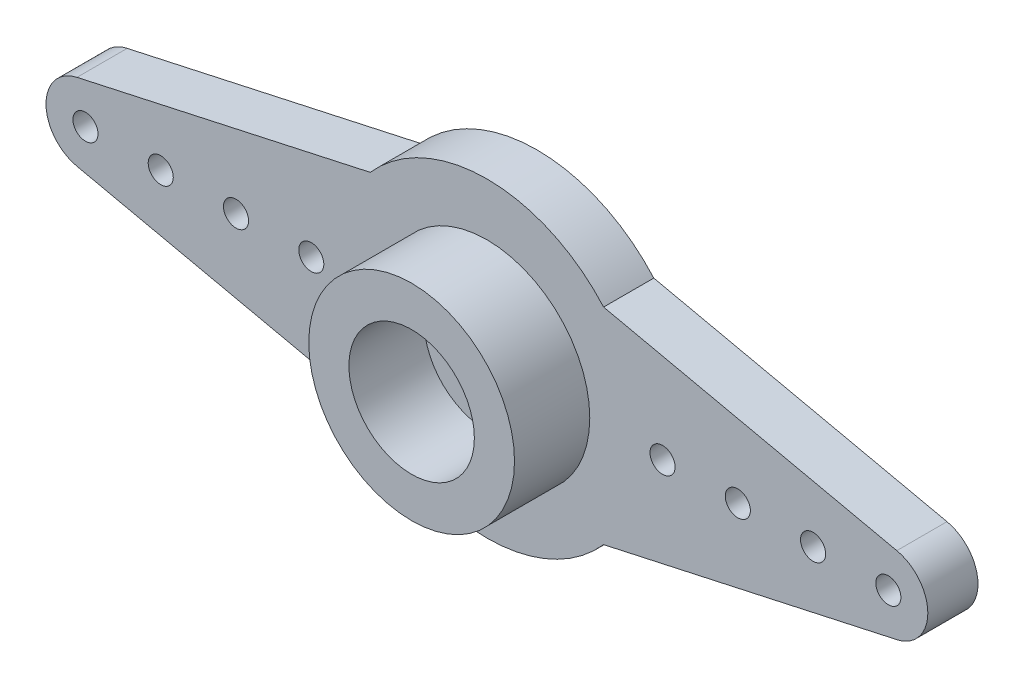
ISO-10303-21;
HEADER;
FILE_DESCRIPTION(('STEP AP214'),'2;1');
FILE_NAME('part.step','',(''),(''),'','','');
FILE_SCHEMA(('AUTOMOTIVE_DESIGN { 1 0 10303 214 1 1 1 1 }'));
ENDSEC;
DATA;
#1=APPLICATION_CONTEXT('core data for automotive mechanical design processes');
#2=APPLICATION_PROTOCOL_DEFINITION('international standard','automotive_design',2000,#1);
#3=PRODUCT_CONTEXT('',#1,'mechanical');
#4=PRODUCT('Part','Part','',(#3));
#5=PRODUCT_RELATED_PRODUCT_CATEGORY('part','',(#4));
#6=PRODUCT_DEFINITION_FORMATION('','',#4);
#7=PRODUCT_DEFINITION_CONTEXT('part definition',#1,'design');
#8=PRODUCT_DEFINITION('design','',#6,#7);
#9=PRODUCT_DEFINITION_SHAPE('','',#8);
#10=(LENGTH_UNIT() NAMED_UNIT(*) SI_UNIT(.MILLI.,.METRE.));
#11=(NAMED_UNIT(*) PLANE_ANGLE_UNIT() SI_UNIT($,.RADIAN.));
#12=(NAMED_UNIT(*) SI_UNIT($,.STERADIAN.) SOLID_ANGLE_UNIT());
#13=UNCERTAINTY_MEASURE_WITH_UNIT(LENGTH_MEASURE(1.E-05),#10,'distance_accuracy_value','');
#14=(GEOMETRIC_REPRESENTATION_CONTEXT(3) GLOBAL_UNCERTAINTY_ASSIGNED_CONTEXT((#13)) GLOBAL_UNIT_ASSIGNED_CONTEXT((#10,
#11,#12)) REPRESENTATION_CONTEXT('',''));
#15=CARTESIAN_POINT('',(0.,0.,0.));
#16=DIRECTION('',(0.,0.,1.));
#17=DIRECTION('',(1.,0.,0.));
#18=AXIS2_PLACEMENT_3D('',#15,#16,#17);
#19=CARTESIAN_POINT('',(-16.,0.,2.));
#20=DIRECTION('',(0.,0.,1.));
#21=DIRECTION('',(1.,0.,0.));
#22=AXIS2_PLACEMENT_3D('',#19,#20,#21);
#23=PLANE('',#22);
#24=CARTESIAN_POINT('',(0.,0.,2.));
#25=DIRECTION('',(0.,0.,1.));
#26=DIRECTION('',(1.,0.,0.));
#27=AXIS2_PLACEMENT_3D('',#24,#25,#26);
#28=CIRCLE('',#27,1.5);
#29=CARTESIAN_POINT('',(1.5,0.,2.));
#30=VERTEX_POINT('',#29);
#31=EDGE_CURVE('E217',#30,#30,#28,.T.);
#32=ORIENTED_EDGE('',*,*,#31,.F.);
#33=EDGE_LOOP('',(#32));
#34=FACE_BOUND('',#33,.T.);
#35=CARTESIAN_POINT('',(0.,0.,2.));
#36=DIRECTION('',(0.,0.,1.));
#37=DIRECTION('',(1.,0.,0.));
#38=AXIS2_PLACEMENT_3D('',#35,#36,#37);
#39=CIRCLE('',#38,2.5);
#40=CARTESIAN_POINT('',(2.5,0.,2.));
#41=VERTEX_POINT('',#40);
#42=EDGE_CURVE('E11',#41,#41,#39,.F.);
#43=ORIENTED_EDGE('',*,*,#42,.F.);
#44=EDGE_LOOP('',(#43));
#45=FACE_BOUND('',#44,.T.);
#46=ADVANCED_FACE('F32',(#34,#45),#23,.T.);
#47=CARTESIAN_POINT('',(0.,0.,2.));
#48=DIRECTION('',(0.,0.,1.));
#49=DIRECTION('',(1.,0.,0.));
#50=AXIS2_PLACEMENT_3D('',#47,#48,#49);
#51=CIRCLE('',#50,4.1);
#52=CARTESIAN_POINT('',(4.1,0.,2.));
#53=VERTEX_POINT('',#52);
#54=EDGE_CURVE('E238',#53,#53,#51,.T.);
#55=ORIENTED_EDGE('',*,*,#54,.F.);
#56=EDGE_LOOP('',(#55));
#57=FACE_BOUND('',#56,.T.);
#58=CARTESIAN_POINT('',(-10.,0.,2.));
#59=DIRECTION('',(0.,0.,1.));
#60=DIRECTION('',(1.,0.,0.));
#61=AXIS2_PLACEMENT_3D('',#58,#59,#60);
#62=CIRCLE('',#61,0.500000000000001);
#63=CARTESIAN_POINT('',(-9.5,0.,2.));
#64=VERTEX_POINT('',#63);
#65=EDGE_CURVE('E223',#64,#64,#62,.T.);
#66=ORIENTED_EDGE('',*,*,#65,.F.);
#67=EDGE_LOOP('',(#66));
#68=FACE_BOUND('',#67,.T.);
#69=CARTESIAN_POINT('',(-13.,0.,2.));
#70=DIRECTION('',(0.,0.,1.));
#71=DIRECTION('',(1.,0.,0.));
#72=AXIS2_PLACEMENT_3D('',#69,#70,#71);
#73=CIRCLE('',#72,0.500000000000001);
#74=CARTESIAN_POINT('',(-12.5,0.,2.));
#75=VERTEX_POINT('',#74);
#76=EDGE_CURVE('E211',#75,#75,#73,.T.);
#77=ORIENTED_EDGE('',*,*,#76,.F.);
#78=EDGE_LOOP('',(#77));
#79=FACE_BOUND('',#78,.T.);
#80=CARTESIAN_POINT('',(10.,0.,2.));
#81=DIRECTION('',(0.,0.,1.));
#82=DIRECTION('',(1.,0.,0.));
#83=AXIS2_PLACEMENT_3D('',#80,#81,#82);
#84=CIRCLE('',#83,0.500000000000001);
#85=CARTESIAN_POINT('',(10.5,0.,2.));
#86=VERTEX_POINT('',#85);
#87=EDGE_CURVE('E199',#86,#86,#84,.T.);
#88=ORIENTED_EDGE('',*,*,#87,.F.);
#89=EDGE_LOOP('',(#88));
#90=FACE_BOUND('',#89,.T.);
#91=CARTESIAN_POINT('',(16.,0.,2.));
#92=DIRECTION('',(0.,0.,1.));
#93=DIRECTION('',(1.,0.,0.));
#94=AXIS2_PLACEMENT_3D('',#91,#92,#93);
#95=CIRCLE('',#94,0.499999999999999);
#96=CARTESIAN_POINT('',(16.5,0.,2.));
#97=VERTEX_POINT('',#96);
#98=EDGE_CURVE('E187',#97,#97,#95,.T.);
#99=ORIENTED_EDGE('',*,*,#98,.F.);
#100=EDGE_LOOP('',(#99));
#101=FACE_BOUND('',#100,.T.);
#102=CARTESIAN_POINT('',(-16.,0.,2.));
#103=DIRECTION('',(0.,0.,1.));
#104=DIRECTION('',(1.,0.,0.));
#105=AXIS2_PLACEMENT_3D('',#102,#103,#104);
#106=CIRCLE('',#105,1.57300104216656);
#107=CARTESIAN_POINT('',(-16.3370446951651,1.53646775173388,2.));
#108=VERTEX_POINT('',#107);
#109=CARTESIAN_POINT('',(-16.3370446951651,-1.53646775173388,2.));
#110=VERTEX_POINT('',#109);
#111=EDGE_CURVE('E146',#108,#110,#106,.T.);
#112=ORIENTED_EDGE('',*,*,#111,.T.);
#113=DIRECTION('',(0.976774783071748,-0.214268577152924,0.));
#114=VECTOR('',#113,1.);
#115=CARTESIAN_POINT('',(-4.65080638169339,-4.1,2.));
#116=LINE('',#115,#114);
#117=CARTESIAN_POINT('',(-4.65080638169339,-4.1,2.));
#118=VERTEX_POINT('',#117);
#119=EDGE_CURVE('E93',#110,#118,#116,.T.);
#120=ORIENTED_EDGE('',*,*,#119,.T.);
#121=CARTESIAN_POINT('',(0.,0.,2.));
#122=DIRECTION('',(0.,0.,1.));
#123=DIRECTION('',(-1.,0.,0.));
#124=AXIS2_PLACEMENT_3D('',#121,#122,#123);
#125=CIRCLE('',#124,6.2);
#126=CARTESIAN_POINT('',(4.65080638169339,-4.1,2.));
#127=VERTEX_POINT('',#126);
#128=EDGE_CURVE('E178',#118,#127,#125,.T.);
#129=ORIENTED_EDGE('',*,*,#128,.T.);
#130=DIRECTION('',(0.976774783071748,0.214268577152924,0.));
#131=VECTOR('',#130,1.);
#132=CARTESIAN_POINT('',(16.3370446951651,-1.53646775173388,2.));
#133=LINE('',#132,#131);
#134=CARTESIAN_POINT('',(16.3370446951651,-1.53646775173388,2.));
#135=VERTEX_POINT('',#134);
#136=EDGE_CURVE('E177',#127,#135,#133,.T.);
#137=ORIENTED_EDGE('',*,*,#136,.T.);
#138=CARTESIAN_POINT('',(16.,0.,2.));
#139=DIRECTION('',(0.,0.,1.));
#140=DIRECTION('',(1.,0.,0.));
#141=AXIS2_PLACEMENT_3D('',#138,#139,#140);
#142=CIRCLE('',#141,1.57300104216656);
#143=CARTESIAN_POINT('',(16.3370446951651,1.53646775173388,2.));
#144=VERTEX_POINT('',#143);
#145=EDGE_CURVE('E113',#135,#144,#142,.T.);
#146=ORIENTED_EDGE('',*,*,#145,.T.);
#147=DIRECTION('',(-0.976774783071748,0.214268577152925,0.));
#148=VECTOR('',#147,1.);
#149=CARTESIAN_POINT('',(4.65080638169339,4.1,2.));
#150=LINE('',#149,#148);
#151=CARTESIAN_POINT('',(4.65080638169339,4.1,2.));
#152=VERTEX_POINT('',#151);
#153=EDGE_CURVE('E106',#144,#152,#150,.T.);
#154=ORIENTED_EDGE('',*,*,#153,.T.);
#155=CARTESIAN_POINT('',(0.,0.,2.));
#156=DIRECTION('',(0.,0.,1.));
#157=DIRECTION('',(1.,0.,0.));
#158=AXIS2_PLACEMENT_3D('',#155,#156,#157);
#159=CIRCLE('',#158,6.2);
#160=CARTESIAN_POINT('',(-4.65080638169339,4.1,2.));
#161=VERTEX_POINT('',#160);
#162=EDGE_CURVE('E111',#152,#161,#159,.T.);
#163=ORIENTED_EDGE('',*,*,#162,.T.);
#164=DIRECTION('',(-0.976774783071748,-0.214268577152925,0.));
#165=VECTOR('',#164,1.);
#166=CARTESIAN_POINT('',(-16.3370446951651,1.53646775173388,2.));
#167=LINE('',#166,#165);
#168=EDGE_CURVE('E49',#161,#108,#167,.T.);
#169=ORIENTED_EDGE('',*,*,#168,.T.);
#170=EDGE_LOOP('',(#112,#120,#129,#137,#146,#154,#163,#169));
#171=FACE_BOUND('',#170,.T.);
#172=CARTESIAN_POINT('',(7.,0.,2.));
#173=DIRECTION('',(0.,0.,1.));
#174=DIRECTION('',(1.,0.,0.));
#175=AXIS2_PLACEMENT_3D('',#172,#173,#174);
#176=CIRCLE('',#175,0.500000000000001);
#177=CARTESIAN_POINT('',(7.5,0.,2.));
#178=VERTEX_POINT('',#177);
#179=EDGE_CURVE('E135',#178,#178,#176,.T.);
#180=ORIENTED_EDGE('',*,*,#179,.F.);
#181=EDGE_LOOP('',(#180));
#182=FACE_BOUND('',#181,.T.);
#183=CARTESIAN_POINT('',(13.,0.,2.));
#184=DIRECTION('',(0.,0.,1.));
#185=DIRECTION('',(1.,0.,0.));
#186=AXIS2_PLACEMENT_3D('',#183,#184,#185);
#187=CIRCLE('',#186,0.500000000000001);
#188=CARTESIAN_POINT('',(13.5,0.,2.));
#189=VERTEX_POINT('',#188);
#190=EDGE_CURVE('E193',#189,#189,#187,.T.);
#191=ORIENTED_EDGE('',*,*,#190,.F.);
#192=EDGE_LOOP('',(#191));
#193=FACE_BOUND('',#192,.T.);
#194=CARTESIAN_POINT('',(-16.,0.,2.));
#195=DIRECTION('',(0.,0.,1.));
#196=DIRECTION('',(1.,0.,0.));
#197=AXIS2_PLACEMENT_3D('',#194,#195,#196);
#198=CIRCLE('',#197,0.500000000000001);
#199=CARTESIAN_POINT('',(-15.5,0.,2.));
#200=VERTEX_POINT('',#199);
#201=EDGE_CURVE('E205',#200,#200,#198,.T.);
#202=ORIENTED_EDGE('',*,*,#201,.F.);
#203=EDGE_LOOP('',(#202));
#204=FACE_BOUND('',#203,.T.);
#205=CARTESIAN_POINT('',(-7.,0.,2.));
#206=DIRECTION('',(0.,0.,1.));
#207=DIRECTION('',(1.,0.,0.));
#208=AXIS2_PLACEMENT_3D('',#205,#206,#207);
#209=CIRCLE('',#208,0.500000000000001);
#210=CARTESIAN_POINT('',(-6.5,0.,2.));
#211=VERTEX_POINT('',#210);
#212=EDGE_CURVE('E229',#211,#211,#209,.T.);
#213=ORIENTED_EDGE('',*,*,#212,.F.);
#214=EDGE_LOOP('',(#213));
#215=FACE_BOUND('',#214,.T.);
#216=ADVANCED_FACE('F108',(#57,#68,#79,#90,#101,#171,#182,#193,#204,#215),#23,.T.);
#217=CARTESIAN_POINT('',(-16.,0.,0.));
#218=DIRECTION('',(0.,0.,1.));
#219=DIRECTION('',(1.,0.,0.));
#220=AXIS2_PLACEMENT_3D('',#217,#218,#219);
#221=PLANE('',#220);
#222=CARTESIAN_POINT('',(-16.,0.,0.));
#223=DIRECTION('',(0.,0.,1.));
#224=DIRECTION('',(1.,0.,0.));
#225=AXIS2_PLACEMENT_3D('',#222,#223,#224);
#226=CIRCLE('',#225,1.57300104216656);
#227=CARTESIAN_POINT('',(-16.3370446951651,1.53646775173388,0.));
#228=VERTEX_POINT('',#227);
#229=CARTESIAN_POINT('',(-16.3370446951651,-1.53646775173388,0.));
#230=VERTEX_POINT('',#229);
#231=EDGE_CURVE('E131',#228,#230,#226,.T.);
#232=ORIENTED_EDGE('',*,*,#231,.F.);
#233=DIRECTION('',(-0.976774783071748,-0.214268577152925,0.));
#234=VECTOR('',#233,1.);
#235=CARTESIAN_POINT('',(-16.3370446951651,1.53646775173388,0.));
#236=LINE('',#235,#234);
#237=CARTESIAN_POINT('',(-4.65080638169339,4.1,0.));
#238=VERTEX_POINT('',#237);
#239=EDGE_CURVE('E84',#238,#228,#236,.T.);
#240=ORIENTED_EDGE('',*,*,#239,.F.);
#241=CARTESIAN_POINT('',(0.,0.,0.));
#242=DIRECTION('',(0.,0.,1.));
#243=DIRECTION('',(1.,0.,0.));
#244=AXIS2_PLACEMENT_3D('',#241,#242,#243);
#245=CIRCLE('',#244,6.2);
#246=CARTESIAN_POINT('',(4.65080638169339,4.1,0.));
#247=VERTEX_POINT('',#246);
#248=EDGE_CURVE('E78',#247,#238,#245,.T.);
#249=ORIENTED_EDGE('',*,*,#248,.F.);
#250=DIRECTION('',(-0.976774783071748,0.214268577152925,0.));
#251=VECTOR('',#250,1.);
#252=CARTESIAN_POINT('',(4.65080638169339,4.1,0.));
#253=LINE('',#252,#251);
#254=CARTESIAN_POINT('',(16.3370446951651,1.53646775173388,0.));
#255=VERTEX_POINT('',#254);
#256=EDGE_CURVE('E121',#255,#247,#253,.T.);
#257=ORIENTED_EDGE('',*,*,#256,.F.);
#258=CARTESIAN_POINT('',(16.,0.,0.));
#259=DIRECTION('',(0.,0.,1.));
#260=DIRECTION('',(1.,0.,0.));
#261=AXIS2_PLACEMENT_3D('',#258,#259,#260);
#262=CIRCLE('',#261,1.57300104216656);
#263=CARTESIAN_POINT('',(16.3370446951651,-1.53646775173388,0.));
#264=VERTEX_POINT('',#263);
#265=EDGE_CURVE('E141',#264,#255,#262,.T.);
#266=ORIENTED_EDGE('',*,*,#265,.F.);
#267=DIRECTION('',(0.976774783071748,0.214268577152924,0.));
#268=VECTOR('',#267,1.);
#269=CARTESIAN_POINT('',(16.3370446951651,-1.53646775173388,0.));
#270=LINE('',#269,#268);
#271=CARTESIAN_POINT('',(4.65080638169339,-4.1,0.));
#272=VERTEX_POINT('',#271);
#273=EDGE_CURVE('E139',#272,#264,#270,.T.);
#274=ORIENTED_EDGE('',*,*,#273,.F.);
#275=CARTESIAN_POINT('',(0.,0.,0.));
#276=DIRECTION('',(0.,0.,1.));
#277=DIRECTION('',(-1.,0.,0.));
#278=AXIS2_PLACEMENT_3D('',#275,#276,#277);
#279=CIRCLE('',#278,6.2);
#280=CARTESIAN_POINT('',(-4.65080638169339,-4.1,0.));
#281=VERTEX_POINT('',#280);
#282=EDGE_CURVE('E137',#281,#272,#279,.T.);
#283=ORIENTED_EDGE('',*,*,#282,.F.);
#284=DIRECTION('',(0.976774783071748,-0.214268577152924,0.));
#285=VECTOR('',#284,1.);
#286=CARTESIAN_POINT('',(-4.65080638169339,-4.1,0.));
#287=LINE('',#286,#285);
#288=EDGE_CURVE('E134',#230,#281,#287,.T.);
#289=ORIENTED_EDGE('',*,*,#288,.F.);
#290=EDGE_LOOP('',(#232,#240,#249,#257,#266,#274,#283,#289));
#291=FACE_BOUND('',#290,.T.);
#292=CARTESIAN_POINT('',(7.,0.,0.));
#293=DIRECTION('',(0.,0.,1.));
#294=DIRECTION('',(1.,0.,0.));
#295=AXIS2_PLACEMENT_3D('',#292,#293,#294);
#296=CIRCLE('',#295,0.500000000000001);
#297=CARTESIAN_POINT('',(7.5,0.,0.));
#298=VERTEX_POINT('',#297);
#299=EDGE_CURVE('E184',#298,#298,#296,.T.);
#300=ORIENTED_EDGE('',*,*,#299,.T.);
#301=EDGE_LOOP('',(#300));
#302=FACE_BOUND('',#301,.T.);
#303=CARTESIAN_POINT('',(16.,0.,0.));
#304=DIRECTION('',(0.,0.,1.));
#305=DIRECTION('',(1.,0.,0.));
#306=AXIS2_PLACEMENT_3D('',#303,#304,#305);
#307=CIRCLE('',#306,0.499999999999999);
#308=CARTESIAN_POINT('',(16.5,0.,0.));
#309=VERTEX_POINT('',#308);
#310=EDGE_CURVE('E190',#309,#309,#307,.T.);
#311=ORIENTED_EDGE('',*,*,#310,.T.);
#312=EDGE_LOOP('',(#311));
#313=FACE_BOUND('',#312,.T.);
#314=CARTESIAN_POINT('',(13.,0.,0.));
#315=DIRECTION('',(0.,0.,1.));
#316=DIRECTION('',(1.,0.,0.));
#317=AXIS2_PLACEMENT_3D('',#314,#315,#316);
#318=CIRCLE('',#317,0.500000000000001);
#319=CARTESIAN_POINT('',(13.5,0.,0.));
#320=VERTEX_POINT('',#319);
#321=EDGE_CURVE('E196',#320,#320,#318,.T.);
#322=ORIENTED_EDGE('',*,*,#321,.T.);
#323=EDGE_LOOP('',(#322));
#324=FACE_BOUND('',#323,.T.);
#325=CARTESIAN_POINT('',(10.,0.,0.));
#326=DIRECTION('',(0.,0.,1.));
#327=DIRECTION('',(1.,0.,0.));
#328=AXIS2_PLACEMENT_3D('',#325,#326,#327);
#329=CIRCLE('',#328,0.500000000000001);
#330=CARTESIAN_POINT('',(10.5,0.,0.));
#331=VERTEX_POINT('',#330);
#332=EDGE_CURVE('E202',#331,#331,#329,.T.);
#333=ORIENTED_EDGE('',*,*,#332,.T.);
#334=EDGE_LOOP('',(#333));
#335=FACE_BOUND('',#334,.T.);
#336=CARTESIAN_POINT('',(-16.,0.,0.));
#337=DIRECTION('',(0.,0.,1.));
#338=DIRECTION('',(1.,0.,0.));
#339=AXIS2_PLACEMENT_3D('',#336,#337,#338);
#340=CIRCLE('',#339,0.500000000000001);
#341=CARTESIAN_POINT('',(-15.5,0.,0.));
#342=VERTEX_POINT('',#341);
#343=EDGE_CURVE('E208',#342,#342,#340,.T.);
#344=ORIENTED_EDGE('',*,*,#343,.T.);
#345=EDGE_LOOP('',(#344));
#346=FACE_BOUND('',#345,.T.);
#347=CARTESIAN_POINT('',(-13.,0.,0.));
#348=DIRECTION('',(0.,0.,1.));
#349=DIRECTION('',(1.,0.,0.));
#350=AXIS2_PLACEMENT_3D('',#347,#348,#349);
#351=CIRCLE('',#350,0.500000000000001);
#352=CARTESIAN_POINT('',(-12.5,0.,0.));
#353=VERTEX_POINT('',#352);
#354=EDGE_CURVE('E214',#353,#353,#351,.T.);
#355=ORIENTED_EDGE('',*,*,#354,.T.);
#356=EDGE_LOOP('',(#355));
#357=FACE_BOUND('',#356,.T.);
#358=CARTESIAN_POINT('',(0.,0.,0.));
#359=DIRECTION('',(0.,0.,1.));
#360=DIRECTION('',(1.,0.,0.));
#361=AXIS2_PLACEMENT_3D('',#358,#359,#360);
#362=CIRCLE('',#361,1.5);
#363=CARTESIAN_POINT('',(1.5,0.,0.));
#364=VERTEX_POINT('',#363);
#365=EDGE_CURVE('E220',#364,#364,#362,.T.);
#366=ORIENTED_EDGE('',*,*,#365,.T.);
#367=EDGE_LOOP('',(#366));
#368=FACE_BOUND('',#367,.T.);
#369=CARTESIAN_POINT('',(-10.,0.,0.));
#370=DIRECTION('',(0.,0.,1.));
#371=DIRECTION('',(1.,0.,0.));
#372=AXIS2_PLACEMENT_3D('',#369,#370,#371);
#373=CIRCLE('',#372,0.500000000000001);
#374=CARTESIAN_POINT('',(-9.5,0.,0.));
#375=VERTEX_POINT('',#374);
#376=EDGE_CURVE('E226',#375,#375,#373,.T.);
#377=ORIENTED_EDGE('',*,*,#376,.T.);
#378=EDGE_LOOP('',(#377));
#379=FACE_BOUND('',#378,.T.);
#380=CARTESIAN_POINT('',(-7.,0.,0.));
#381=DIRECTION('',(0.,0.,1.));
#382=DIRECTION('',(1.,0.,0.));
#383=AXIS2_PLACEMENT_3D('',#380,#381,#382);
#384=CIRCLE('',#383,0.500000000000001);
#385=CARTESIAN_POINT('',(-6.5,0.,0.));
#386=VERTEX_POINT('',#385);
#387=EDGE_CURVE('E232',#386,#386,#384,.T.);
#388=ORIENTED_EDGE('',*,*,#387,.T.);
#389=EDGE_LOOP('',(#388));
#390=FACE_BOUND('',#389,.T.);
#391=ADVANCED_FACE('F164',(#291,#302,#313,#324,#335,#346,#357,#368,#379,#390),#221,.F.);
#392=CARTESIAN_POINT('',(-16.,0.,2.));
#393=DIRECTION('',(0.,0.,-1.));
#394=DIRECTION('',(-1.,0.,0.));
#395=AXIS2_PLACEMENT_3D('',#392,#393,#394);
#396=CYLINDRICAL_SURFACE('',#395,1.57300104216656);
#397=ORIENTED_EDGE('',*,*,#231,.T.);
#398=DIRECTION('',(0.,0.,-1.));
#399=VECTOR('',#398,1.);
#400=CARTESIAN_POINT('',(-16.3370446951651,-1.53646775173388,2.));
#401=LINE('',#400,#399);
#402=EDGE_CURVE('E41',#110,#230,#401,.T.);
#403=ORIENTED_EDGE('',*,*,#402,.F.);
#404=ORIENTED_EDGE('',*,*,#111,.F.);
#405=DIRECTION('',(0.,0.,-1.));
#406=VECTOR('',#405,1.);
#407=CARTESIAN_POINT('',(-16.3370446951651,1.53646775173388,2.));
#408=LINE('',#407,#406);
#409=EDGE_CURVE('E127',#108,#228,#408,.T.);
#410=ORIENTED_EDGE('',*,*,#409,.T.);
#411=EDGE_LOOP('',(#397,#403,#404,#410));
#412=FACE_BOUND('',#411,.T.);
#413=ADVANCED_FACE('F34',(#412),#396,.T.);
#414=CARTESIAN_POINT('',(-4.65080638169339,-4.1,2.));
#415=DIRECTION('',(0.214268577152924,0.976774783071749,0.));
#416=DIRECTION('',(-0.976774783071749,0.214268577152924,0.));
#417=AXIS2_PLACEMENT_3D('',#414,#415,#416);
#418=PLANE('',#417);
#419=ORIENTED_EDGE('',*,*,#288,.T.);
#420=DIRECTION('',(0.,0.,-1.));
#421=VECTOR('',#420,1.);
#422=CARTESIAN_POINT('',(-4.65080638169339,-4.1,2.));
#423=LINE('',#422,#421);
#424=EDGE_CURVE('E156',#118,#281,#423,.T.);
#425=ORIENTED_EDGE('',*,*,#424,.F.);
#426=ORIENTED_EDGE('',*,*,#119,.F.);
#427=ORIENTED_EDGE('',*,*,#402,.T.);
#428=EDGE_LOOP('',(#419,#425,#426,#427));
#429=FACE_BOUND('',#428,.T.);
#430=ADVANCED_FACE('F159',(#429),#418,.F.);
#431=CARTESIAN_POINT('',(0.,0.,2.));
#432=DIRECTION('',(0.,0.,-1.));
#433=DIRECTION('',(-1.,0.,0.));
#434=AXIS2_PLACEMENT_3D('',#431,#432,#433);
#435=CYLINDRICAL_SURFACE('',#434,6.2);
#436=ORIENTED_EDGE('',*,*,#282,.T.);
#437=DIRECTION('',(0.,0.,-1.));
#438=VECTOR('',#437,1.);
#439=CARTESIAN_POINT('',(4.65080638169339,-4.1,2.));
#440=LINE('',#439,#438);
#441=EDGE_CURVE('E153',#127,#272,#440,.T.);
#442=ORIENTED_EDGE('',*,*,#441,.F.);
#443=ORIENTED_EDGE('',*,*,#128,.F.);
#444=ORIENTED_EDGE('',*,*,#424,.T.);
#445=EDGE_LOOP('',(#436,#442,#443,#444));
#446=FACE_BOUND('',#445,.T.);
#447=ADVANCED_FACE('F171',(#446),#435,.T.);
#448=CARTESIAN_POINT('',(16.3370446951651,-1.53646775173388,2.));
#449=DIRECTION('',(-0.214268577152924,0.976774783071749,0.));
#450=DIRECTION('',(-0.976774783071749,-0.214268577152924,0.));
#451=AXIS2_PLACEMENT_3D('',#448,#449,#450);
#452=PLANE('',#451);
#453=ORIENTED_EDGE('',*,*,#273,.T.);
#454=DIRECTION('',(0.,0.,-1.));
#455=VECTOR('',#454,1.);
#456=CARTESIAN_POINT('',(16.3370446951651,-1.53646775173388,2.));
#457=LINE('',#456,#455);
#458=EDGE_CURVE('E150',#135,#264,#457,.T.);
#459=ORIENTED_EDGE('',*,*,#458,.F.);
#460=ORIENTED_EDGE('',*,*,#136,.F.);
#461=ORIENTED_EDGE('',*,*,#441,.T.);
#462=EDGE_LOOP('',(#453,#459,#460,#461));
#463=FACE_BOUND('',#462,.T.);
#464=ADVANCED_FACE('F175',(#463),#452,.F.);
#465=CARTESIAN_POINT('',(16.,0.,2.));
#466=DIRECTION('',(0.,0.,-1.));
#467=DIRECTION('',(-1.,0.,0.));
#468=AXIS2_PLACEMENT_3D('',#465,#466,#467);
#469=CYLINDRICAL_SURFACE('',#468,1.57300104216656);
#470=ORIENTED_EDGE('',*,*,#265,.T.);
#471=DIRECTION('',(0.,0.,-1.));
#472=VECTOR('',#471,1.);
#473=CARTESIAN_POINT('',(16.3370446951651,1.53646775173388,2.));
#474=LINE('',#473,#472);
#475=EDGE_CURVE('E122',#144,#255,#474,.T.);
#476=ORIENTED_EDGE('',*,*,#475,.F.);
#477=ORIENTED_EDGE('',*,*,#145,.F.);
#478=ORIENTED_EDGE('',*,*,#458,.T.);
#479=EDGE_LOOP('',(#470,#476,#477,#478));
#480=FACE_BOUND('',#479,.T.);
#481=ADVANCED_FACE('F288',(#480),#469,.T.);
#482=CARTESIAN_POINT('',(4.65080638169339,4.1,2.));
#483=DIRECTION('',(-0.214268577152925,-0.976774783071748,0.));
#484=DIRECTION('',(0.976774783071749,-0.214268577152925,0.));
#485=AXIS2_PLACEMENT_3D('',#482,#483,#484);
#486=PLANE('',#485);
#487=ORIENTED_EDGE('',*,*,#256,.T.);
#488=DIRECTION('',(0.,0.,-1.));
#489=VECTOR('',#488,1.);
#490=CARTESIAN_POINT('',(4.65080638169339,4.1,2.));
#491=LINE('',#490,#489);
#492=EDGE_CURVE('E118',#152,#247,#491,.T.);
#493=ORIENTED_EDGE('',*,*,#492,.F.);
#494=ORIENTED_EDGE('',*,*,#153,.F.);
#495=ORIENTED_EDGE('',*,*,#475,.T.);
#496=EDGE_LOOP('',(#487,#493,#494,#495));
#497=FACE_BOUND('',#496,.T.);
#498=ADVANCED_FACE('F119',(#497),#486,.F.);
#499=CARTESIAN_POINT('',(0.,0.,2.));
#500=DIRECTION('',(0.,0.,-1.));
#501=DIRECTION('',(-1.,0.,0.));
#502=AXIS2_PLACEMENT_3D('',#499,#500,#501);
#503=CYLINDRICAL_SURFACE('',#502,6.2);
#504=ORIENTED_EDGE('',*,*,#248,.T.);
#505=DIRECTION('',(0.,0.,-1.));
#506=VECTOR('',#505,1.);
#507=CARTESIAN_POINT('',(-4.65080638169339,4.1,2.));
#508=LINE('',#507,#506);
#509=EDGE_CURVE('E123',#161,#238,#508,.T.);
#510=ORIENTED_EDGE('',*,*,#509,.F.);
#511=ORIENTED_EDGE('',*,*,#162,.F.);
#512=ORIENTED_EDGE('',*,*,#492,.T.);
#513=EDGE_LOOP('',(#504,#510,#511,#512));
#514=FACE_BOUND('',#513,.T.);
#515=ADVANCED_FACE('F125',(#514),#503,.T.);
#516=CARTESIAN_POINT('',(-16.3370446951651,1.53646775173388,2.));
#517=DIRECTION('',(0.214268577152925,-0.976774783071748,0.));
#518=DIRECTION('',(0.976774783071749,0.214268577152925,0.));
#519=AXIS2_PLACEMENT_3D('',#516,#517,#518);
#520=PLANE('',#519);
#521=ORIENTED_EDGE('',*,*,#239,.T.);
#522=ORIENTED_EDGE('',*,*,#409,.F.);
#523=ORIENTED_EDGE('',*,*,#168,.F.);
#524=ORIENTED_EDGE('',*,*,#509,.T.);
#525=EDGE_LOOP('',(#521,#522,#523,#524));
#526=FACE_BOUND('',#525,.T.);
#527=ADVANCED_FACE('F281',(#526),#520,.F.);
#528=CARTESIAN_POINT('',(7.,0.,2.));
#529=DIRECTION('',(0.,0.,-1.));
#530=DIRECTION('',(-1.,0.,0.));
#531=AXIS2_PLACEMENT_3D('',#528,#529,#530);
#532=CYLINDRICAL_SURFACE('',#531,0.500000000000001);
#533=ORIENTED_EDGE('',*,*,#179,.T.);
#534=EDGE_LOOP('',(#533));
#535=FACE_BOUND('',#534,.T.);
#536=ORIENTED_EDGE('',*,*,#299,.F.);
#537=EDGE_LOOP('',(#536));
#538=FACE_BOUND('',#537,.T.);
#539=ADVANCED_FACE('F277',(#535,#538),#532,.F.);
#540=CARTESIAN_POINT('',(16.,0.,2.));
#541=DIRECTION('',(0.,0.,-1.));
#542=DIRECTION('',(-1.,0.,0.));
#543=AXIS2_PLACEMENT_3D('',#540,#541,#542);
#544=CYLINDRICAL_SURFACE('',#543,0.499999999999999);
#545=ORIENTED_EDGE('',*,*,#98,.T.);
#546=EDGE_LOOP('',(#545));
#547=FACE_BOUND('',#546,.T.);
#548=ORIENTED_EDGE('',*,*,#310,.F.);
#549=EDGE_LOOP('',(#548));
#550=FACE_BOUND('',#549,.T.);
#551=ADVANCED_FACE('F390',(#547,#550),#544,.F.);
#552=CARTESIAN_POINT('',(13.,0.,2.));
#553=DIRECTION('',(0.,0.,-1.));
#554=DIRECTION('',(-1.,0.,0.));
#555=AXIS2_PLACEMENT_3D('',#552,#553,#554);
#556=CYLINDRICAL_SURFACE('',#555,0.500000000000001);
#557=ORIENTED_EDGE('',*,*,#190,.T.);
#558=EDGE_LOOP('',(#557));
#559=FACE_BOUND('',#558,.T.);
#560=ORIENTED_EDGE('',*,*,#321,.F.);
#561=EDGE_LOOP('',(#560));
#562=FACE_BOUND('',#561,.T.);
#563=ADVANCED_FACE('F381',(#559,#562),#556,.F.);
#564=CARTESIAN_POINT('',(10.,0.,2.));
#565=DIRECTION('',(0.,0.,-1.));
#566=DIRECTION('',(-1.,0.,0.));
#567=AXIS2_PLACEMENT_3D('',#564,#565,#566);
#568=CYLINDRICAL_SURFACE('',#567,0.500000000000001);
#569=ORIENTED_EDGE('',*,*,#87,.T.);
#570=EDGE_LOOP('',(#569));
#571=FACE_BOUND('',#570,.T.);
#572=ORIENTED_EDGE('',*,*,#332,.F.);
#573=EDGE_LOOP('',(#572));
#574=FACE_BOUND('',#573,.T.);
#575=ADVANCED_FACE('F372',(#571,#574),#568,.F.);
#576=CARTESIAN_POINT('',(-16.,0.,2.));
#577=DIRECTION('',(0.,0.,-1.));
#578=DIRECTION('',(-1.,0.,0.));
#579=AXIS2_PLACEMENT_3D('',#576,#577,#578);
#580=CYLINDRICAL_SURFACE('',#579,0.500000000000001);
#581=ORIENTED_EDGE('',*,*,#201,.T.);
#582=EDGE_LOOP('',(#581));
#583=FACE_BOUND('',#582,.T.);
#584=ORIENTED_EDGE('',*,*,#343,.F.);
#585=EDGE_LOOP('',(#584));
#586=FACE_BOUND('',#585,.T.);
#587=ADVANCED_FACE('F363',(#583,#586),#580,.F.);
#588=CARTESIAN_POINT('',(-13.,0.,2.));
#589=DIRECTION('',(0.,0.,-1.));
#590=DIRECTION('',(-1.,0.,0.));
#591=AXIS2_PLACEMENT_3D('',#588,#589,#590);
#592=CYLINDRICAL_SURFACE('',#591,0.500000000000001);
#593=ORIENTED_EDGE('',*,*,#76,.T.);
#594=EDGE_LOOP('',(#593));
#595=FACE_BOUND('',#594,.T.);
#596=ORIENTED_EDGE('',*,*,#354,.F.);
#597=EDGE_LOOP('',(#596));
#598=FACE_BOUND('',#597,.T.);
#599=ADVANCED_FACE('F354',(#595,#598),#592,.F.);
#600=CARTESIAN_POINT('',(0.,0.,2.));
#601=DIRECTION('',(0.,0.,-1.));
#602=DIRECTION('',(-1.,0.,0.));
#603=AXIS2_PLACEMENT_3D('',#600,#601,#602);
#604=CYLINDRICAL_SURFACE('',#603,1.5);
#605=ORIENTED_EDGE('',*,*,#31,.T.);
#606=EDGE_LOOP('',(#605));
#607=FACE_BOUND('',#606,.T.);
#608=ORIENTED_EDGE('',*,*,#365,.F.);
#609=EDGE_LOOP('',(#608));
#610=FACE_BOUND('',#609,.T.);
#611=ADVANCED_FACE('F345',(#607,#610),#604,.F.);
#612=CARTESIAN_POINT('',(-10.,0.,2.));
#613=DIRECTION('',(0.,0.,-1.));
#614=DIRECTION('',(-1.,0.,0.));
#615=AXIS2_PLACEMENT_3D('',#612,#613,#614);
#616=CYLINDRICAL_SURFACE('',#615,0.500000000000001);
#617=ORIENTED_EDGE('',*,*,#65,.T.);
#618=EDGE_LOOP('',(#617));
#619=FACE_BOUND('',#618,.T.);
#620=ORIENTED_EDGE('',*,*,#376,.F.);
#621=EDGE_LOOP('',(#620));
#622=FACE_BOUND('',#621,.T.);
#623=ADVANCED_FACE('F262',(#619,#622),#616,.F.);
#624=CARTESIAN_POINT('',(-7.,0.,2.));
#625=DIRECTION('',(0.,0.,-1.));
#626=DIRECTION('',(-1.,0.,0.));
#627=AXIS2_PLACEMENT_3D('',#624,#625,#626);
#628=CYLINDRICAL_SURFACE('',#627,0.500000000000001);
#629=ORIENTED_EDGE('',*,*,#212,.T.);
#630=EDGE_LOOP('',(#629));
#631=FACE_BOUND('',#630,.T.);
#632=ORIENTED_EDGE('',*,*,#387,.F.);
#633=EDGE_LOOP('',(#632));
#634=FACE_BOUND('',#633,.T.);
#635=ADVANCED_FACE('F253',(#631,#634),#628,.F.);
#636=CARTESIAN_POINT('',(0.,0.,5.));
#637=DIRECTION('',(0.,0.,1.));
#638=DIRECTION('',(1.,0.,0.));
#639=AXIS2_PLACEMENT_3D('',#636,#637,#638);
#640=PLANE('',#639);
#641=CARTESIAN_POINT('',(0.,0.,5.));
#642=DIRECTION('',(0.,0.,1.));
#643=DIRECTION('',(1.,0.,0.));
#644=AXIS2_PLACEMENT_3D('',#641,#642,#643);
#645=CIRCLE('',#644,4.1);
#646=CARTESIAN_POINT('',(4.1,0.,5.));
#647=VERTEX_POINT('',#646);
#648=EDGE_CURVE('E235',#647,#647,#645,.T.);
#649=ORIENTED_EDGE('',*,*,#648,.T.);
#650=EDGE_LOOP('',(#649));
#651=FACE_BOUND('',#650,.T.);
#652=CARTESIAN_POINT('',(0.,0.,5.));
#653=DIRECTION('',(0.,0.,1.));
#654=DIRECTION('',(1.,0.,0.));
#655=AXIS2_PLACEMENT_3D('',#652,#653,#654);
#656=CIRCLE('',#655,2.5);
#657=CARTESIAN_POINT('',(2.5,0.,5.));
#658=VERTEX_POINT('',#657);
#659=EDGE_CURVE('E241',#658,#658,#656,.T.);
#660=ORIENTED_EDGE('',*,*,#659,.F.);
#661=EDGE_LOOP('',(#660));
#662=FACE_BOUND('',#661,.T.);
#663=ADVANCED_FACE('F250',(#651,#662),#640,.T.);
#664=CARTESIAN_POINT('',(0.,0.,5.));
#665=DIRECTION('',(0.,0.,-1.));
#666=DIRECTION('',(-1.,0.,0.));
#667=AXIS2_PLACEMENT_3D('',#664,#665,#666);
#668=CYLINDRICAL_SURFACE('',#667,4.1);
#669=ORIENTED_EDGE('',*,*,#648,.F.);
#670=EDGE_LOOP('',(#669));
#671=FACE_BOUND('',#670,.T.);
#672=ORIENTED_EDGE('',*,*,#54,.T.);
#673=EDGE_LOOP('',(#672));
#674=FACE_BOUND('',#673,.T.);
#675=ADVANCED_FACE('F252',(#671,#674),#668,.T.);
#676=CARTESIAN_POINT('',(0.,0.,5.));
#677=DIRECTION('',(0.,0.,-1.));
#678=DIRECTION('',(-1.,0.,0.));
#679=AXIS2_PLACEMENT_3D('',#676,#677,#678);
#680=CYLINDRICAL_SURFACE('',#679,2.5);
#681=ORIENTED_EDGE('',*,*,#659,.T.);
#682=EDGE_LOOP('',(#681));
#683=FACE_BOUND('',#682,.T.);
#684=ORIENTED_EDGE('',*,*,#42,.T.);
#685=EDGE_LOOP('',(#684));
#686=FACE_BOUND('',#685,.T.);
#687=ADVANCED_FACE('F247',(#683,#686),#680,.F.);
#688=CLOSED_SHELL('',(#46,#216,#391,#413,#430,#447,#464,#481,#498,#515,#527,#539,#551,#563,#575,
#587,#599,#611,#623,#635,#663,#675,#687));
#689=MANIFOLD_SOLID_BREP('B2',#688);
#690=ADVANCED_BREP_SHAPE_REPRESENTATION('',(#18,#689),#14);
#691=SHAPE_DEFINITION_REPRESENTATION(#9,#690);
ENDSEC;
END-ISO-10303-21;
